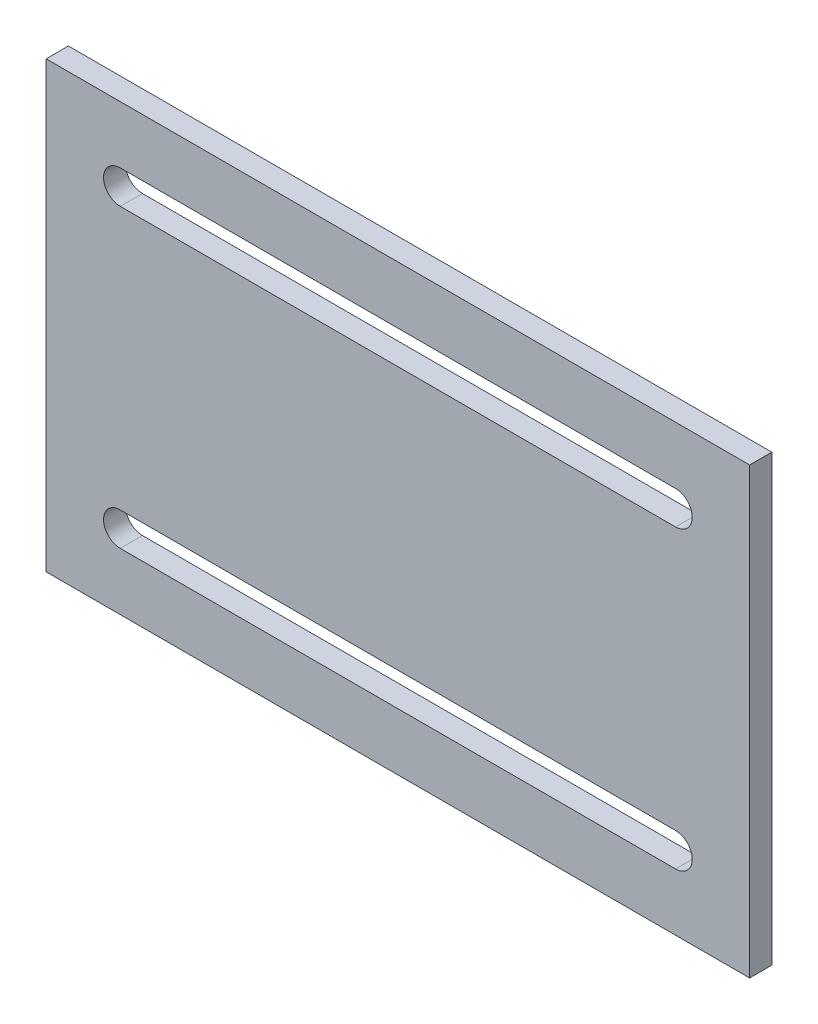
ISO-10303-21;
HEADER;
FILE_DESCRIPTION(('STEP AP214'),'2;1');
FILE_NAME('part.step','',(''),(''),'','','');
FILE_SCHEMA(('AUTOMOTIVE_DESIGN { 1 0 10303 214 1 1 1 1 }'));
ENDSEC;
DATA;
#1=APPLICATION_CONTEXT('core data for automotive mechanical design processes');
#2=APPLICATION_PROTOCOL_DEFINITION('international standard','automotive_design',2000,#1);
#3=PRODUCT_CONTEXT('',#1,'mechanical');
#4=PRODUCT('Part','Part','',(#3));
#5=PRODUCT_RELATED_PRODUCT_CATEGORY('part','',(#4));
#6=PRODUCT_DEFINITION_FORMATION('','',#4);
#7=PRODUCT_DEFINITION_CONTEXT('part definition',#1,'design');
#8=PRODUCT_DEFINITION('design','',#6,#7);
#9=PRODUCT_DEFINITION_SHAPE('','',#8);
#10=(LENGTH_UNIT() NAMED_UNIT(*) SI_UNIT(.MILLI.,.METRE.));
#11=(NAMED_UNIT(*) PLANE_ANGLE_UNIT() SI_UNIT($,.RADIAN.));
#12=(NAMED_UNIT(*) SI_UNIT($,.STERADIAN.) SOLID_ANGLE_UNIT());
#13=UNCERTAINTY_MEASURE_WITH_UNIT(LENGTH_MEASURE(1.E-05),#10,'distance_accuracy_value','');
#14=(GEOMETRIC_REPRESENTATION_CONTEXT(3) GLOBAL_UNCERTAINTY_ASSIGNED_CONTEXT((#13)) GLOBAL_UNIT_ASSIGNED_CONTEXT((#10,
#11,#12)) REPRESENTATION_CONTEXT('',''));
#15=CARTESIAN_POINT('',(0.,0.,0.));
#16=DIRECTION('',(0.,0.,1.));
#17=DIRECTION('',(1.,0.,0.));
#18=AXIS2_PLACEMENT_3D('',#15,#16,#17);
#19=CARTESIAN_POINT('',(0.,0.,12.));
#20=DIRECTION('',(0.,0.,-1.));
#21=DIRECTION('',(-1.,0.,0.));
#22=AXIS2_PLACEMENT_3D('',#19,#20,#21);
#23=PLANE('',#22);
#24=CARTESIAN_POINT('',(-150.,80.,12.));
#25=DIRECTION('',(0.,0.,1.));
#26=DIRECTION('',(1.,0.,0.));
#27=AXIS2_PLACEMENT_3D('',#24,#25,#26);
#28=CIRCLE('',#27,8.99999999999999);
#29=CARTESIAN_POINT('',(-150.,89.,12.));
#30=VERTEX_POINT('',#29);
#31=CARTESIAN_POINT('',(-150.,71.,12.));
#32=VERTEX_POINT('',#31);
#33=EDGE_CURVE('E169',#30,#32,#28,.T.);
#34=ORIENTED_EDGE('',*,*,#33,.F.);
#35=DIRECTION('',(-1.,0.,0.));
#36=VECTOR('',#35,1.);
#37=CARTESIAN_POINT('',(-150.,89.,12.));
#38=LINE('',#37,#36);
#39=CARTESIAN_POINT('',(150.,89.,12.));
#40=VERTEX_POINT('',#39);
#41=EDGE_CURVE('E179',#40,#30,#38,.T.);
#42=ORIENTED_EDGE('',*,*,#41,.F.);
#43=CARTESIAN_POINT('',(150.,80.,12.));
#44=DIRECTION('',(0.,0.,1.));
#45=DIRECTION('',(1.,0.,0.));
#46=AXIS2_PLACEMENT_3D('',#43,#44,#45);
#47=CIRCLE('',#46,8.99999999999999);
#48=CARTESIAN_POINT('',(150.,71.,12.));
#49=VERTEX_POINT('',#48);
#50=EDGE_CURVE('E176',#49,#40,#47,.T.);
#51=ORIENTED_EDGE('',*,*,#50,.F.);
#52=DIRECTION('',(1.,0.,0.));
#53=VECTOR('',#52,1.);
#54=CARTESIAN_POINT('',(-150.,71.,12.));
#55=LINE('',#54,#53);
#56=EDGE_CURVE('E172',#32,#49,#55,.T.);
#57=ORIENTED_EDGE('',*,*,#56,.F.);
#58=EDGE_LOOP('',(#34,#42,#51,#57));
#59=FACE_BOUND('',#58,.T.);
#60=DIRECTION('',(0.,-1.,0.));
#61=VECTOR('',#60,1.);
#62=CARTESIAN_POINT('',(-190.,-120.,12.));
#63=LINE('',#62,#61);
#64=CARTESIAN_POINT('',(-190.,120.,12.));
#65=VERTEX_POINT('',#64);
#66=CARTESIAN_POINT('',(-190.,-120.,12.));
#67=VERTEX_POINT('',#66);
#68=EDGE_CURVE('E207',#65,#67,#63,.T.);
#69=ORIENTED_EDGE('',*,*,#68,.T.);
#70=DIRECTION('',(1.,0.,0.));
#71=VECTOR('',#70,1.);
#72=CARTESIAN_POINT('',(-190.,-120.,12.));
#73=LINE('',#72,#71);
#74=CARTESIAN_POINT('',(190.,-120.,12.));
#75=VERTEX_POINT('',#74);
#76=EDGE_CURVE('E210',#67,#75,#73,.T.);
#77=ORIENTED_EDGE('',*,*,#76,.T.);
#78=DIRECTION('',(0.,1.,0.));
#79=VECTOR('',#78,1.);
#80=CARTESIAN_POINT('',(190.,-120.,12.));
#81=LINE('',#80,#79);
#82=CARTESIAN_POINT('',(190.,120.,12.));
#83=VERTEX_POINT('',#82);
#84=EDGE_CURVE('E213',#75,#83,#81,.T.);
#85=ORIENTED_EDGE('',*,*,#84,.T.);
#86=DIRECTION('',(-1.,0.,0.));
#87=VECTOR('',#86,1.);
#88=CARTESIAN_POINT('',(-190.,120.,12.));
#89=LINE('',#88,#87);
#90=EDGE_CURVE('E215',#83,#65,#89,.T.);
#91=ORIENTED_EDGE('',*,*,#90,.T.);
#92=EDGE_LOOP('',(#69,#77,#85,#91));
#93=FACE_BOUND('',#92,.T.);
#94=CARTESIAN_POINT('',(-150.,-80.0000000000001,12.));
#95=DIRECTION('',(0.,0.,1.));
#96=DIRECTION('',(-1.,0.,0.));
#97=AXIS2_PLACEMENT_3D('',#94,#95,#96);
#98=CIRCLE('',#97,8.99999999999999);
#99=CARTESIAN_POINT('',(-150.,-71.0000000000001,12.));
#100=VERTEX_POINT('',#99);
#101=CARTESIAN_POINT('',(-150.,-89.0000000000001,12.));
#102=VERTEX_POINT('',#101);
#103=EDGE_CURVE('E133',#100,#102,#98,.T.);
#104=ORIENTED_EDGE('',*,*,#103,.F.);
#105=DIRECTION('',(-1.,0.,0.));
#106=VECTOR('',#105,1.);
#107=CARTESIAN_POINT('',(-150.,-71.0000000000001,12.));
#108=LINE('',#107,#106);
#109=CARTESIAN_POINT('',(150.,-71.0000000000001,12.));
#110=VERTEX_POINT('',#109);
#111=EDGE_CURVE('E155',#110,#100,#108,.T.);
#112=ORIENTED_EDGE('',*,*,#111,.F.);
#113=CARTESIAN_POINT('',(150.,-80.0000000000001,12.));
#114=DIRECTION('',(0.,0.,1.));
#115=DIRECTION('',(-1.,0.,0.));
#116=AXIS2_PLACEMENT_3D('',#113,#114,#115);
#117=CIRCLE('',#116,8.99999999999999);
#118=CARTESIAN_POINT('',(150.,-89.0000000000001,12.));
#119=VERTEX_POINT('',#118);
#120=EDGE_CURVE('E153',#119,#110,#117,.T.);
#121=ORIENTED_EDGE('',*,*,#120,.F.);
#122=DIRECTION('',(1.,0.,0.));
#123=VECTOR('',#122,1.);
#124=CARTESIAN_POINT('',(-150.,-89.0000000000001,12.));
#125=LINE('',#124,#123);
#126=EDGE_CURVE('E141',#102,#119,#125,.T.);
#127=ORIENTED_EDGE('',*,*,#126,.F.);
#128=EDGE_LOOP('',(#104,#112,#121,#127));
#129=FACE_BOUND('',#128,.T.);
#130=ADVANCED_FACE('F41',(#59,#93,#129),#23,.F.);
#131=CARTESIAN_POINT('',(0.,0.,0.));
#132=DIRECTION('',(0.,0.,-1.));
#133=DIRECTION('',(-1.,0.,0.));
#134=AXIS2_PLACEMENT_3D('',#131,#132,#133);
#135=PLANE('',#134);
#136=DIRECTION('',(-1.,0.,0.));
#137=VECTOR('',#136,1.);
#138=CARTESIAN_POINT('',(-150.,89.,0.));
#139=LINE('',#138,#137);
#140=CARTESIAN_POINT('',(150.,89.,0.));
#141=VERTEX_POINT('',#140);
#142=CARTESIAN_POINT('',(-150.,89.,0.));
#143=VERTEX_POINT('',#142);
#144=EDGE_CURVE('E173',#141,#143,#139,.T.);
#145=ORIENTED_EDGE('',*,*,#144,.T.);
#146=CARTESIAN_POINT('',(-150.,80.,0.));
#147=DIRECTION('',(0.,0.,1.));
#148=DIRECTION('',(1.,0.,0.));
#149=AXIS2_PLACEMENT_3D('',#146,#147,#148);
#150=CIRCLE('',#149,8.99999999999999);
#151=CARTESIAN_POINT('',(-150.,71.,0.));
#152=VERTEX_POINT('',#151);
#153=EDGE_CURVE('E149',#143,#152,#150,.T.);
#154=ORIENTED_EDGE('',*,*,#153,.T.);
#155=DIRECTION('',(1.,0.,0.));
#156=VECTOR('',#155,1.);
#157=CARTESIAN_POINT('',(-150.,71.,0.));
#158=LINE('',#157,#156);
#159=CARTESIAN_POINT('',(150.,71.,0.));
#160=VERTEX_POINT('',#159);
#161=EDGE_CURVE('E186',#152,#160,#158,.T.);
#162=ORIENTED_EDGE('',*,*,#161,.T.);
#163=CARTESIAN_POINT('',(150.,80.,0.));
#164=DIRECTION('',(0.,0.,1.));
#165=DIRECTION('',(1.,0.,0.));
#166=AXIS2_PLACEMENT_3D('',#163,#164,#165);
#167=CIRCLE('',#166,8.99999999999999);
#168=EDGE_CURVE('E189',#160,#141,#167,.T.);
#169=ORIENTED_EDGE('',*,*,#168,.T.);
#170=EDGE_LOOP('',(#145,#154,#162,#169));
#171=FACE_BOUND('',#170,.T.);
#172=DIRECTION('',(0.,-1.,0.));
#173=VECTOR('',#172,1.);
#174=CARTESIAN_POINT('',(-190.,-120.,0.));
#175=LINE('',#174,#173);
#176=CARTESIAN_POINT('',(-190.,120.,0.));
#177=VERTEX_POINT('',#176);
#178=CARTESIAN_POINT('',(-190.,-120.,0.));
#179=VERTEX_POINT('',#178);
#180=EDGE_CURVE('E206',#177,#179,#175,.T.);
#181=ORIENTED_EDGE('',*,*,#180,.F.);
#182=DIRECTION('',(-1.,0.,0.));
#183=VECTOR('',#182,1.);
#184=CARTESIAN_POINT('',(-190.,120.,0.));
#185=LINE('',#184,#183);
#186=CARTESIAN_POINT('',(190.,120.,0.));
#187=VERTEX_POINT('',#186);
#188=EDGE_CURVE('E211',#187,#177,#185,.T.);
#189=ORIENTED_EDGE('',*,*,#188,.F.);
#190=DIRECTION('',(0.,1.,0.));
#191=VECTOR('',#190,1.);
#192=CARTESIAN_POINT('',(190.,-120.,0.));
#193=LINE('',#192,#191);
#194=CARTESIAN_POINT('',(190.,-120.,0.));
#195=VERTEX_POINT('',#194);
#196=EDGE_CURVE('E223',#195,#187,#193,.T.);
#197=ORIENTED_EDGE('',*,*,#196,.F.);
#198=DIRECTION('',(1.,0.,0.));
#199=VECTOR('',#198,1.);
#200=CARTESIAN_POINT('',(-190.,-120.,0.));
#201=LINE('',#200,#199);
#202=EDGE_CURVE('E221',#179,#195,#201,.T.);
#203=ORIENTED_EDGE('',*,*,#202,.F.);
#204=EDGE_LOOP('',(#181,#189,#197,#203));
#205=FACE_BOUND('',#204,.T.);
#206=DIRECTION('',(-1.,0.,0.));
#207=VECTOR('',#206,1.);
#208=CARTESIAN_POINT('',(-150.,-71.0000000000001,0.));
#209=LINE('',#208,#207);
#210=CARTESIAN_POINT('',(150.,-71.0000000000001,0.));
#211=VERTEX_POINT('',#210);
#212=CARTESIAN_POINT('',(-150.,-71.0000000000001,0.));
#213=VERTEX_POINT('',#212);
#214=EDGE_CURVE('E142',#211,#213,#209,.T.);
#215=ORIENTED_EDGE('',*,*,#214,.T.);
#216=CARTESIAN_POINT('',(-150.,-80.0000000000001,0.));
#217=DIRECTION('',(0.,0.,1.));
#218=DIRECTION('',(-1.,0.,0.));
#219=AXIS2_PLACEMENT_3D('',#216,#217,#218);
#220=CIRCLE('',#219,8.99999999999999);
#221=CARTESIAN_POINT('',(-150.,-89.0000000000001,0.));
#222=VERTEX_POINT('',#221);
#223=EDGE_CURVE('E64',#213,#222,#220,.T.);
#224=ORIENTED_EDGE('',*,*,#223,.T.);
#225=DIRECTION('',(1.,0.,0.));
#226=VECTOR('',#225,1.);
#227=CARTESIAN_POINT('',(-150.,-89.0000000000001,0.));
#228=LINE('',#227,#226);
#229=CARTESIAN_POINT('',(150.,-89.0000000000001,0.));
#230=VERTEX_POINT('',#229);
#231=EDGE_CURVE('E148',#222,#230,#228,.T.);
#232=ORIENTED_EDGE('',*,*,#231,.T.);
#233=CARTESIAN_POINT('',(150.,-80.0000000000001,0.));
#234=DIRECTION('',(0.,0.,1.));
#235=DIRECTION('',(-1.,0.,0.));
#236=AXIS2_PLACEMENT_3D('',#233,#234,#235);
#237=CIRCLE('',#236,8.99999999999999);
#238=EDGE_CURVE('E161',#230,#211,#237,.T.);
#239=ORIENTED_EDGE('',*,*,#238,.T.);
#240=EDGE_LOOP('',(#215,#224,#232,#239));
#241=FACE_BOUND('',#240,.T.);
#242=ADVANCED_FACE('F242',(#171,#205,#241),#135,.T.);
#243=CARTESIAN_POINT('',(-190.,-120.,12.));
#244=DIRECTION('',(1.,0.,0.));
#245=DIRECTION('',(0.,0.,-1.));
#246=AXIS2_PLACEMENT_3D('',#243,#244,#245);
#247=PLANE('',#246);
#248=ORIENTED_EDGE('',*,*,#180,.T.);
#249=DIRECTION('',(0.,0.,-1.));
#250=VECTOR('',#249,1.);
#251=CARTESIAN_POINT('',(-190.,-120.,12.));
#252=LINE('',#251,#250);
#253=EDGE_CURVE('E11',#67,#179,#252,.T.);
#254=ORIENTED_EDGE('',*,*,#253,.F.);
#255=ORIENTED_EDGE('',*,*,#68,.F.);
#256=DIRECTION('',(0.,0.,-1.));
#257=VECTOR('',#256,1.);
#258=CARTESIAN_POINT('',(-190.,120.,12.));
#259=LINE('',#258,#257);
#260=EDGE_CURVE('E218',#65,#177,#259,.T.);
#261=ORIENTED_EDGE('',*,*,#260,.T.);
#262=EDGE_LOOP('',(#248,#254,#255,#261));
#263=FACE_BOUND('',#262,.T.);
#264=ADVANCED_FACE('F43',(#263),#247,.F.);
#265=CARTESIAN_POINT('',(-190.,-120.,12.));
#266=DIRECTION('',(0.,1.,0.));
#267=DIRECTION('',(0.,0.,1.));
#268=AXIS2_PLACEMENT_3D('',#265,#266,#267);
#269=PLANE('',#268);
#270=ORIENTED_EDGE('',*,*,#202,.T.);
#271=DIRECTION('',(0.,0.,-1.));
#272=VECTOR('',#271,1.);
#273=CARTESIAN_POINT('',(190.,-120.,12.));
#274=LINE('',#273,#272);
#275=EDGE_CURVE('E49',#75,#195,#274,.T.);
#276=ORIENTED_EDGE('',*,*,#275,.F.);
#277=ORIENTED_EDGE('',*,*,#76,.F.);
#278=ORIENTED_EDGE('',*,*,#253,.T.);
#279=EDGE_LOOP('',(#270,#276,#277,#278));
#280=FACE_BOUND('',#279,.T.);
#281=ADVANCED_FACE('F252',(#280),#269,.F.);
#282=CARTESIAN_POINT('',(190.,-120.,12.));
#283=DIRECTION('',(-1.,0.,0.));
#284=DIRECTION('',(0.,-1.,0.));
#285=AXIS2_PLACEMENT_3D('',#282,#283,#284);
#286=PLANE('',#285);
#287=ORIENTED_EDGE('',*,*,#196,.T.);
#288=DIRECTION('',(0.,0.,-1.));
#289=VECTOR('',#288,1.);
#290=CARTESIAN_POINT('',(190.,120.,12.));
#291=LINE('',#290,#289);
#292=EDGE_CURVE('E229',#83,#187,#291,.T.);
#293=ORIENTED_EDGE('',*,*,#292,.F.);
#294=ORIENTED_EDGE('',*,*,#84,.F.);
#295=ORIENTED_EDGE('',*,*,#275,.T.);
#296=EDGE_LOOP('',(#287,#293,#294,#295));
#297=FACE_BOUND('',#296,.T.);
#298=ADVANCED_FACE('F236',(#297),#286,.F.);
#299=CARTESIAN_POINT('',(-190.,120.,12.));
#300=DIRECTION('',(0.,-1.,0.));
#301=DIRECTION('',(1.,0.,0.));
#302=AXIS2_PLACEMENT_3D('',#299,#300,#301);
#303=PLANE('',#302);
#304=ORIENTED_EDGE('',*,*,#188,.T.);
#305=ORIENTED_EDGE('',*,*,#260,.F.);
#306=ORIENTED_EDGE('',*,*,#90,.F.);
#307=ORIENTED_EDGE('',*,*,#292,.T.);
#308=EDGE_LOOP('',(#304,#305,#306,#307));
#309=FACE_BOUND('',#308,.T.);
#310=ADVANCED_FACE('F246',(#309),#303,.F.);
#311=CARTESIAN_POINT('',(-150.,80.,12.));
#312=DIRECTION('',(0.,0.,-1.));
#313=DIRECTION('',(-1.,0.,0.));
#314=AXIS2_PLACEMENT_3D('',#311,#312,#313);
#315=CYLINDRICAL_SURFACE('',#314,8.99999999999999);
#316=ORIENTED_EDGE('',*,*,#153,.F.);
#317=DIRECTION('',(0.,0.,-1.));
#318=VECTOR('',#317,1.);
#319=CARTESIAN_POINT('',(-150.,89.,12.));
#320=LINE('',#319,#318);
#321=EDGE_CURVE('E182',#30,#143,#320,.T.);
#322=ORIENTED_EDGE('',*,*,#321,.F.);
#323=ORIENTED_EDGE('',*,*,#33,.T.);
#324=DIRECTION('',(0.,0.,-1.));
#325=VECTOR('',#324,1.);
#326=CARTESIAN_POINT('',(-150.,71.,12.));
#327=LINE('',#326,#325);
#328=EDGE_CURVE('E202',#32,#152,#327,.T.);
#329=ORIENTED_EDGE('',*,*,#328,.T.);
#330=EDGE_LOOP('',(#316,#322,#323,#329));
#331=FACE_BOUND('',#330,.T.);
#332=ADVANCED_FACE('F269',(#331),#315,.F.);
#333=CARTESIAN_POINT('',(-150.,71.,12.));
#334=DIRECTION('',(0.,1.,0.));
#335=DIRECTION('',(0.,0.,1.));
#336=AXIS2_PLACEMENT_3D('',#333,#334,#335);
#337=PLANE('',#336);
#338=ORIENTED_EDGE('',*,*,#161,.F.);
#339=ORIENTED_EDGE('',*,*,#328,.F.);
#340=ORIENTED_EDGE('',*,*,#56,.T.);
#341=DIRECTION('',(0.,0.,-1.));
#342=VECTOR('',#341,1.);
#343=CARTESIAN_POINT('',(150.,71.,12.));
#344=LINE('',#343,#342);
#345=EDGE_CURVE('E200',#49,#160,#344,.T.);
#346=ORIENTED_EDGE('',*,*,#345,.T.);
#347=EDGE_LOOP('',(#338,#339,#340,#346));
#348=FACE_BOUND('',#347,.T.);
#349=ADVANCED_FACE('F276',(#348),#337,.T.);
#350=CARTESIAN_POINT('',(150.,80.,12.));
#351=DIRECTION('',(0.,0.,-1.));
#352=DIRECTION('',(-1.,0.,0.));
#353=AXIS2_PLACEMENT_3D('',#350,#351,#352);
#354=CYLINDRICAL_SURFACE('',#353,8.99999999999999);
#355=ORIENTED_EDGE('',*,*,#168,.F.);
#356=ORIENTED_EDGE('',*,*,#345,.F.);
#357=ORIENTED_EDGE('',*,*,#50,.T.);
#358=DIRECTION('',(0.,0.,-1.));
#359=VECTOR('',#358,1.);
#360=CARTESIAN_POINT('',(150.,89.,12.));
#361=LINE('',#360,#359);
#362=EDGE_CURVE('E198',#40,#141,#361,.T.);
#363=ORIENTED_EDGE('',*,*,#362,.T.);
#364=EDGE_LOOP('',(#355,#356,#357,#363));
#365=FACE_BOUND('',#364,.T.);
#366=ADVANCED_FACE('F281',(#365),#354,.F.);
#367=CARTESIAN_POINT('',(-150.,89.,12.));
#368=DIRECTION('',(0.,-1.,0.));
#369=DIRECTION('',(0.,0.,-1.));
#370=AXIS2_PLACEMENT_3D('',#367,#368,#369);
#371=PLANE('',#370);
#372=ORIENTED_EDGE('',*,*,#144,.F.);
#373=ORIENTED_EDGE('',*,*,#362,.F.);
#374=ORIENTED_EDGE('',*,*,#41,.T.);
#375=ORIENTED_EDGE('',*,*,#321,.T.);
#376=EDGE_LOOP('',(#372,#373,#374,#375));
#377=FACE_BOUND('',#376,.T.);
#378=ADVANCED_FACE('F287',(#377),#371,.T.);
#379=CARTESIAN_POINT('',(-150.,-80.0000000000001,12.));
#380=DIRECTION('',(0.,0.,-1.));
#381=DIRECTION('',(-1.,0.,0.));
#382=AXIS2_PLACEMENT_3D('',#379,#380,#381);
#383=CYLINDRICAL_SURFACE('',#382,8.99999999999999);
#384=ORIENTED_EDGE('',*,*,#223,.F.);
#385=DIRECTION('',(0.,0.,-1.));
#386=VECTOR('',#385,1.);
#387=CARTESIAN_POINT('',(-150.,-71.0000000000001,12.));
#388=LINE('',#387,#386);
#389=EDGE_CURVE('E137',#100,#213,#388,.T.);
#390=ORIENTED_EDGE('',*,*,#389,.F.);
#391=ORIENTED_EDGE('',*,*,#103,.T.);
#392=DIRECTION('',(0.,0.,-1.));
#393=VECTOR('',#392,1.);
#394=CARTESIAN_POINT('',(-150.,-89.0000000000001,12.));
#395=LINE('',#394,#393);
#396=EDGE_CURVE('E136',#102,#222,#395,.T.);
#397=ORIENTED_EDGE('',*,*,#396,.T.);
#398=EDGE_LOOP('',(#384,#390,#391,#397));
#399=FACE_BOUND('',#398,.T.);
#400=ADVANCED_FACE('F135',(#399),#383,.F.);
#401=CARTESIAN_POINT('',(-150.,-89.0000000000001,12.));
#402=DIRECTION('',(0.,1.,0.));
#403=DIRECTION('',(0.,0.,1.));
#404=AXIS2_PLACEMENT_3D('',#401,#402,#403);
#405=PLANE('',#404);
#406=ORIENTED_EDGE('',*,*,#231,.F.);
#407=ORIENTED_EDGE('',*,*,#396,.F.);
#408=ORIENTED_EDGE('',*,*,#126,.T.);
#409=DIRECTION('',(0.,0.,-1.));
#410=VECTOR('',#409,1.);
#411=CARTESIAN_POINT('',(150.,-89.0000000000001,12.));
#412=LINE('',#411,#410);
#413=EDGE_CURVE('E150',#119,#230,#412,.T.);
#414=ORIENTED_EDGE('',*,*,#413,.T.);
#415=EDGE_LOOP('',(#406,#407,#408,#414));
#416=FACE_BOUND('',#415,.T.);
#417=ADVANCED_FACE('F145',(#416),#405,.T.);
#418=CARTESIAN_POINT('',(150.,-80.0000000000001,12.));
#419=DIRECTION('',(0.,0.,-1.));
#420=DIRECTION('',(-1.,0.,0.));
#421=AXIS2_PLACEMENT_3D('',#418,#419,#420);
#422=CYLINDRICAL_SURFACE('',#421,8.99999999999999);
#423=ORIENTED_EDGE('',*,*,#238,.F.);
#424=ORIENTED_EDGE('',*,*,#413,.F.);
#425=ORIENTED_EDGE('',*,*,#120,.T.);
#426=DIRECTION('',(0.,0.,-1.));
#427=VECTOR('',#426,1.);
#428=CARTESIAN_POINT('',(150.,-71.0000000000001,12.));
#429=LINE('',#428,#427);
#430=EDGE_CURVE('E56',#110,#211,#429,.T.);
#431=ORIENTED_EDGE('',*,*,#430,.T.);
#432=EDGE_LOOP('',(#423,#424,#425,#431));
#433=FACE_BOUND('',#432,.T.);
#434=ADVANCED_FACE('F305',(#433),#422,.F.);
#435=CARTESIAN_POINT('',(-150.,-71.0000000000001,12.));
#436=DIRECTION('',(0.,-1.,0.));
#437=DIRECTION('',(0.,0.,-1.));
#438=AXIS2_PLACEMENT_3D('',#435,#436,#437);
#439=PLANE('',#438);
#440=ORIENTED_EDGE('',*,*,#214,.F.);
#441=ORIENTED_EDGE('',*,*,#430,.F.);
#442=ORIENTED_EDGE('',*,*,#111,.T.);
#443=ORIENTED_EDGE('',*,*,#389,.T.);
#444=EDGE_LOOP('',(#440,#441,#442,#443));
#445=FACE_BOUND('',#444,.T.);
#446=ADVANCED_FACE('F308',(#445),#439,.T.);
#447=CLOSED_SHELL('',(#130,#242,#264,#281,#298,#310,#332,#349,#366,#378,#400,#417,#434,#446));
#448=MANIFOLD_SOLID_BREP('B2',#447);
#449=ADVANCED_BREP_SHAPE_REPRESENTATION('',(#18,#448),#14);
#450=SHAPE_DEFINITION_REPRESENTATION(#9,#449);
ENDSEC;
END-ISO-10303-21;
